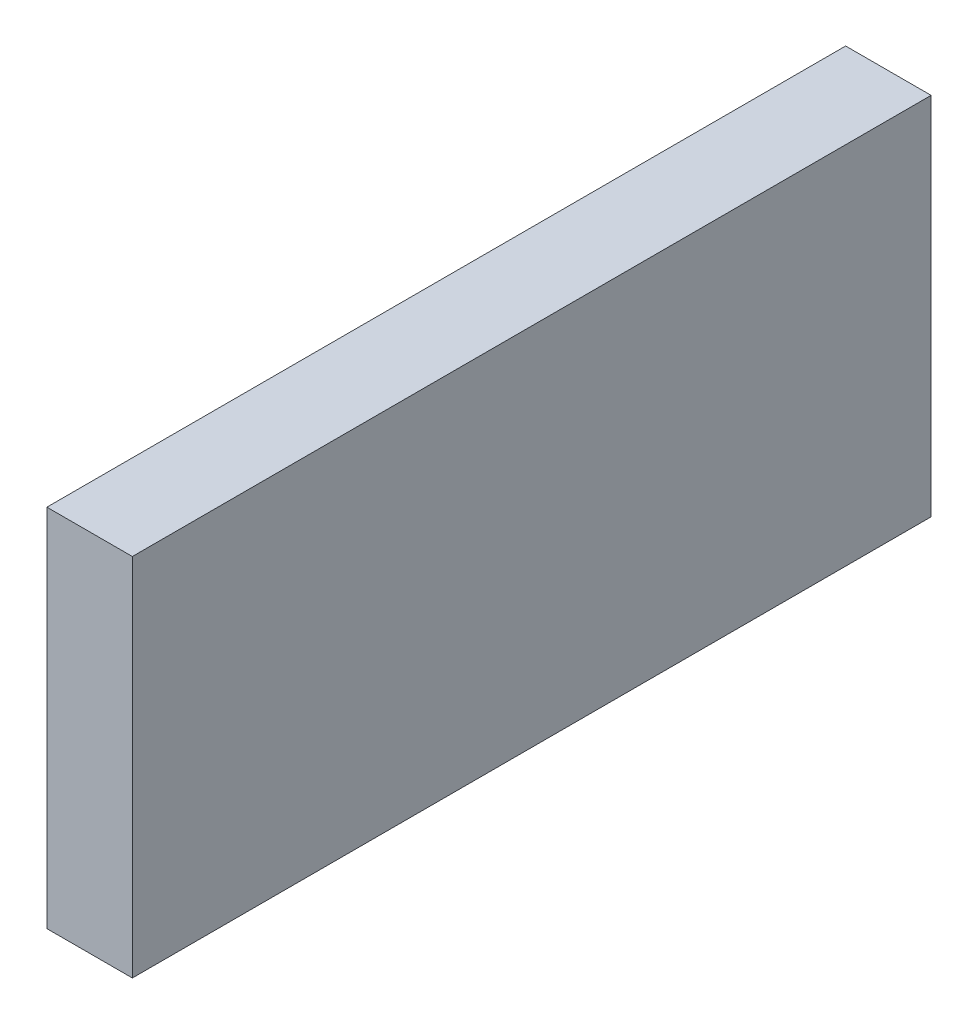
ISO-10303-21;
HEADER;
FILE_DESCRIPTION(('STEP AP214'),'2;1');
FILE_NAME('part.step','',(''),(''),'','','');
FILE_SCHEMA(('AUTOMOTIVE_DESIGN { 1 0 10303 214 1 1 1 1 }'));
ENDSEC;
DATA;
#1=APPLICATION_CONTEXT('core data for automotive mechanical design processes');
#2=APPLICATION_PROTOCOL_DEFINITION('international standard','automotive_design',2000,#1);
#3=PRODUCT_CONTEXT('',#1,'mechanical');
#4=PRODUCT('Part','Part','',(#3));
#5=PRODUCT_RELATED_PRODUCT_CATEGORY('part','',(#4));
#6=PRODUCT_DEFINITION_FORMATION('','',#4);
#7=PRODUCT_DEFINITION_CONTEXT('part definition',#1,'design');
#8=PRODUCT_DEFINITION('design','',#6,#7);
#9=PRODUCT_DEFINITION_SHAPE('','',#8);
#10=(LENGTH_UNIT() NAMED_UNIT(*) SI_UNIT(.MILLI.,.METRE.));
#11=(NAMED_UNIT(*) PLANE_ANGLE_UNIT() SI_UNIT($,.RADIAN.));
#12=(NAMED_UNIT(*) SI_UNIT($,.STERADIAN.) SOLID_ANGLE_UNIT());
#13=UNCERTAINTY_MEASURE_WITH_UNIT(LENGTH_MEASURE(1.E-05),#10,'distance_accuracy_value','');
#14=(GEOMETRIC_REPRESENTATION_CONTEXT(3) GLOBAL_UNCERTAINTY_ASSIGNED_CONTEXT((#13)) GLOBAL_UNIT_ASSIGNED_CONTEXT((#10,
#11,#12)) REPRESENTATION_CONTEXT('',''));
#15=CARTESIAN_POINT('',(0.,0.,0.));
#16=DIRECTION('',(0.,0.,1.));
#17=DIRECTION('',(1.,0.,0.));
#18=AXIS2_PLACEMENT_3D('',#15,#16,#17);
#19=CARTESIAN_POINT('',(0.37449252,-1.59949134,0.));
#20=DIRECTION('',(-1.,0.,0.));
#21=DIRECTION('',(0.,0.,1.));
#22=AXIS2_PLACEMENT_3D('',#19,#20,#21);
#23=PLANE('',#22);
#24=DIRECTION('',(0.,0.,-1.));
#25=VECTOR('',#24,1.);
#26=CARTESIAN_POINT('',(0.37449252,1.59949134,0.));
#27=LINE('',#26,#25);
#28=CARTESIAN_POINT('',(0.37449252,1.59949134,0.));
#29=VERTEX_POINT('',#28);
#30=CARTESIAN_POINT('',(0.37449252,1.59949134,7.));
#31=VERTEX_POINT('',#30);
#32=EDGE_CURVE('E20',#29,#31,#27,.F.);
#33=ORIENTED_EDGE('',*,*,#32,.T.);
#34=DIRECTION('',(0.,1.,0.));
#35=VECTOR('',#34,1.);
#36=CARTESIAN_POINT('',(0.37449252,1.59949134,7.));
#37=LINE('',#36,#35);
#38=CARTESIAN_POINT('',(0.37449252,-1.59949134,7.));
#39=VERTEX_POINT('',#38);
#40=EDGE_CURVE('E55',#31,#39,#37,.F.);
#41=ORIENTED_EDGE('',*,*,#40,.T.);
#42=DIRECTION('',(0.,0.,1.));
#43=VECTOR('',#42,1.);
#44=CARTESIAN_POINT('',(0.37449252,-1.59949134,0.));
#45=LINE('',#44,#43);
#46=CARTESIAN_POINT('',(0.37449252,-1.59949134,0.));
#47=VERTEX_POINT('',#46);
#48=EDGE_CURVE('E76',#39,#47,#45,.F.);
#49=ORIENTED_EDGE('',*,*,#48,.T.);
#50=DIRECTION('',(0.,1.,0.));
#51=VECTOR('',#50,1.);
#52=CARTESIAN_POINT('',(0.37449252,1.59949134,0.));
#53=LINE('',#52,#51);
#54=EDGE_CURVE('E58',#29,#47,#53,.F.);
#55=ORIENTED_EDGE('',*,*,#54,.F.);
#56=EDGE_LOOP('',(#33,#41,#49,#55));
#57=FACE_BOUND('',#56,.T.);
#58=ADVANCED_FACE('F17',(#57),#23,.F.);
#59=CARTESIAN_POINT('',(0.37449252,1.59949134,0.));
#60=DIRECTION('',(0.,-1.,0.));
#61=DIRECTION('',(0.,0.,-1.));
#62=AXIS2_PLACEMENT_3D('',#59,#60,#61);
#63=PLANE('',#62);
#64=DIRECTION('',(0.,0.,-1.));
#65=VECTOR('',#64,1.);
#66=CARTESIAN_POINT('',(-0.37449252,1.59949134,0.));
#67=LINE('',#66,#65);
#68=CARTESIAN_POINT('',(-0.37449252,1.59949134,0.));
#69=VERTEX_POINT('',#68);
#70=CARTESIAN_POINT('',(-0.37449252,1.59949134,7.));
#71=VERTEX_POINT('',#70);
#72=EDGE_CURVE('E73',#69,#71,#67,.F.);
#73=ORIENTED_EDGE('',*,*,#72,.T.);
#74=DIRECTION('',(-1.,0.,0.));
#75=VECTOR('',#74,1.);
#76=CARTESIAN_POINT('',(-0.37449252,1.59949134,7.));
#77=LINE('',#76,#75);
#78=EDGE_CURVE('E63',#71,#31,#77,.F.);
#79=ORIENTED_EDGE('',*,*,#78,.T.);
#80=ORIENTED_EDGE('',*,*,#32,.F.);
#81=DIRECTION('',(-1.,0.,0.));
#82=VECTOR('',#81,1.);
#83=CARTESIAN_POINT('',(-0.37449252,1.59949134,0.));
#84=LINE('',#83,#82);
#85=EDGE_CURVE('E78',#69,#29,#84,.F.);
#86=ORIENTED_EDGE('',*,*,#85,.F.);
#87=EDGE_LOOP('',(#73,#79,#80,#86));
#88=FACE_BOUND('',#87,.T.);
#89=ADVANCED_FACE('F72',(#88),#63,.F.);
#90=CARTESIAN_POINT('',(-0.37449252,1.59949134,7.));
#91=DIRECTION('',(0.,0.,-1.));
#92=DIRECTION('',(-1.,0.,0.));
#93=AXIS2_PLACEMENT_3D('',#90,#91,#92);
#94=PLANE('',#93);
#95=DIRECTION('',(1.,0.,0.));
#96=VECTOR('',#95,1.);
#97=CARTESIAN_POINT('',(-0.37449252,-1.59949134,7.));
#98=LINE('',#97,#96);
#99=CARTESIAN_POINT('',(-0.37449252,-1.59949134,7.));
#100=VERTEX_POINT('',#99);
#101=EDGE_CURVE('E69',#100,#39,#98,.T.);
#102=ORIENTED_EDGE('',*,*,#101,.T.);
#103=ORIENTED_EDGE('',*,*,#40,.F.);
#104=ORIENTED_EDGE('',*,*,#78,.F.);
#105=DIRECTION('',(0.,1.,0.));
#106=VECTOR('',#105,1.);
#107=CARTESIAN_POINT('',(-0.37449252,1.59949134,7.));
#108=LINE('',#107,#106);
#109=EDGE_CURVE('E83',#71,#100,#108,.F.);
#110=ORIENTED_EDGE('',*,*,#109,.T.);
#111=EDGE_LOOP('',(#102,#103,#104,#110));
#112=FACE_BOUND('',#111,.T.);
#113=ADVANCED_FACE('F66',(#112),#94,.F.);
#114=CARTESIAN_POINT('',(-0.37449252,-1.59949134,0.));
#115=DIRECTION('',(0.,1.,0.));
#116=DIRECTION('',(0.,0.,1.));
#117=AXIS2_PLACEMENT_3D('',#114,#115,#116);
#118=PLANE('',#117);
#119=ORIENTED_EDGE('',*,*,#48,.F.);
#120=ORIENTED_EDGE('',*,*,#101,.F.);
#121=DIRECTION('',(0.,0.,-1.));
#122=VECTOR('',#121,1.);
#123=CARTESIAN_POINT('',(-0.37449252,-1.59949134,0.));
#124=LINE('',#123,#122);
#125=CARTESIAN_POINT('',(-0.37449252,-1.59949134,0.));
#126=VERTEX_POINT('',#125);
#127=EDGE_CURVE('E26',#100,#126,#124,.T.);
#128=ORIENTED_EDGE('',*,*,#127,.T.);
#129=DIRECTION('',(-1.,0.,0.));
#130=VECTOR('',#129,1.);
#131=CARTESIAN_POINT('',(-0.37449252,-1.59949134,0.));
#132=LINE('',#131,#130);
#133=EDGE_CURVE('E34',#47,#126,#132,.T.);
#134=ORIENTED_EDGE('',*,*,#133,.F.);
#135=EDGE_LOOP('',(#119,#120,#128,#134));
#136=FACE_BOUND('',#135,.T.);
#137=ADVANCED_FACE('F88',(#136),#118,.F.);
#138=CARTESIAN_POINT('',(-0.37449252,1.59949134,0.));
#139=DIRECTION('',(0.,0.,-1.));
#140=DIRECTION('',(-1.,0.,0.));
#141=AXIS2_PLACEMENT_3D('',#138,#139,#140);
#142=PLANE('',#141);
#143=ORIENTED_EDGE('',*,*,#133,.T.);
#144=DIRECTION('',(0.,1.,0.));
#145=VECTOR('',#144,1.);
#146=CARTESIAN_POINT('',(-0.37449252,1.59949134,0.));
#147=LINE('',#146,#145);
#148=EDGE_CURVE('E11',#126,#69,#147,.T.);
#149=ORIENTED_EDGE('',*,*,#148,.T.);
#150=ORIENTED_EDGE('',*,*,#85,.T.);
#151=ORIENTED_EDGE('',*,*,#54,.T.);
#152=EDGE_LOOP('',(#143,#149,#150,#151));
#153=FACE_BOUND('',#152,.T.);
#154=ADVANCED_FACE('F91',(#153),#142,.T.);
#155=CARTESIAN_POINT('',(-0.37449252,1.59949134,0.));
#156=DIRECTION('',(1.,0.,0.));
#157=DIRECTION('',(0.,0.,-1.));
#158=AXIS2_PLACEMENT_3D('',#155,#156,#157);
#159=PLANE('',#158);
#160=ORIENTED_EDGE('',*,*,#127,.F.);
#161=ORIENTED_EDGE('',*,*,#109,.F.);
#162=ORIENTED_EDGE('',*,*,#72,.F.);
#163=ORIENTED_EDGE('',*,*,#148,.F.);
#164=EDGE_LOOP('',(#160,#161,#162,#163));
#165=FACE_BOUND('',#164,.T.);
#166=ADVANCED_FACE('F90',(#165),#159,.F.);
#167=CLOSED_SHELL('',(#58,#89,#113,#137,#154,#166));
#168=MANIFOLD_SOLID_BREP('B1',#167);
#169=ADVANCED_BREP_SHAPE_REPRESENTATION('',(#18,#168),#14);
#170=SHAPE_DEFINITION_REPRESENTATION(#9,#169);
ENDSEC;
END-ISO-10303-21;
